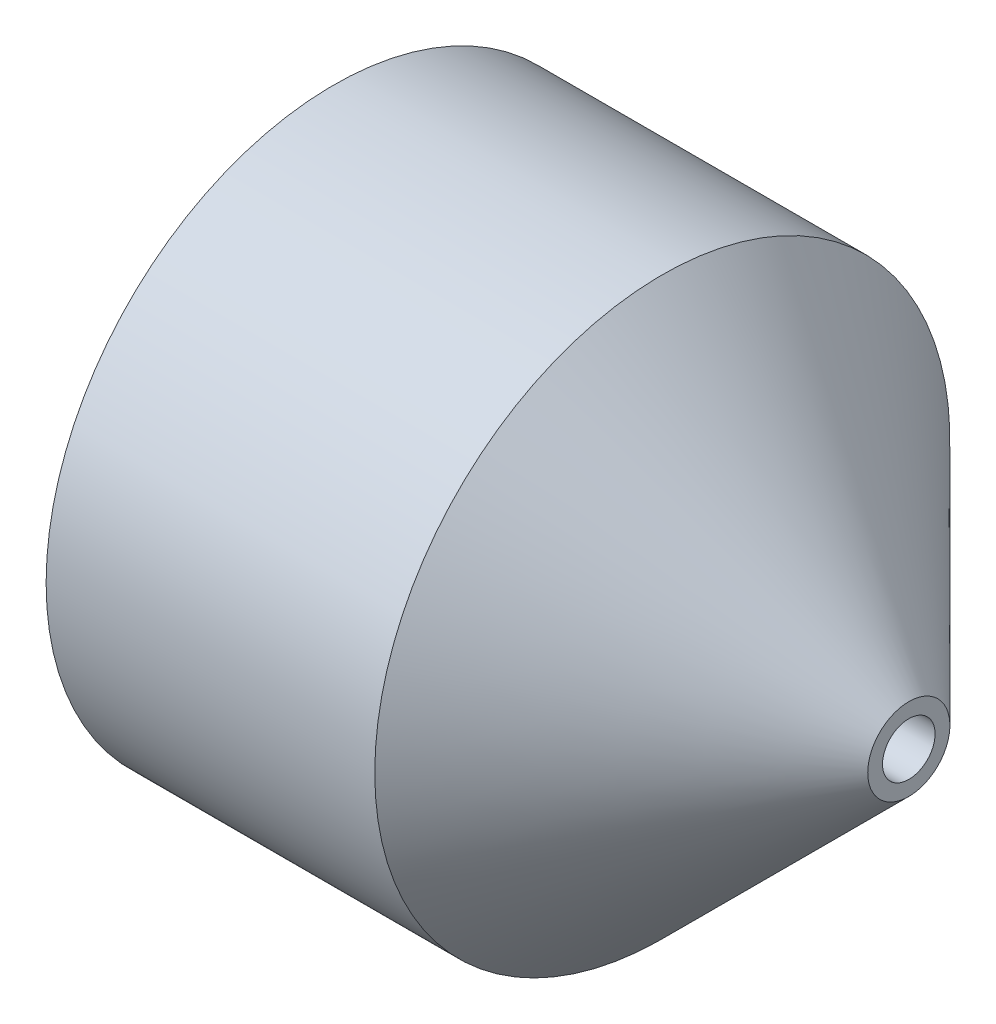
ISO-10303-21;
HEADER;
FILE_DESCRIPTION(('STEP AP214'),'2;1');
FILE_NAME('part.step','',(''),(''),'','','');
FILE_SCHEMA(('AUTOMOTIVE_DESIGN { 1 0 10303 214 1 1 1 1 }'));
ENDSEC;
DATA;
#1=APPLICATION_CONTEXT('core data for automotive mechanical design processes');
#2=APPLICATION_PROTOCOL_DEFINITION('international standard','automotive_design',2000,#1);
#3=PRODUCT_CONTEXT('',#1,'mechanical');
#4=PRODUCT('Part','Part','',(#3));
#5=PRODUCT_RELATED_PRODUCT_CATEGORY('part','',(#4));
#6=PRODUCT_DEFINITION_FORMATION('','',#4);
#7=PRODUCT_DEFINITION_CONTEXT('part definition',#1,'design');
#8=PRODUCT_DEFINITION('design','',#6,#7);
#9=PRODUCT_DEFINITION_SHAPE('','',#8);
#10=(LENGTH_UNIT() NAMED_UNIT(*) SI_UNIT(.MILLI.,.METRE.));
#11=(NAMED_UNIT(*) PLANE_ANGLE_UNIT() SI_UNIT($,.RADIAN.));
#12=(NAMED_UNIT(*) SI_UNIT($,.STERADIAN.) SOLID_ANGLE_UNIT());
#13=UNCERTAINTY_MEASURE_WITH_UNIT(LENGTH_MEASURE(1.E-05),#10,'distance_accuracy_value','');
#14=(GEOMETRIC_REPRESENTATION_CONTEXT(3) GLOBAL_UNCERTAINTY_ASSIGNED_CONTEXT((#13)) GLOBAL_UNIT_ASSIGNED_CONTEXT((#10,
#11,#12)) REPRESENTATION_CONTEXT('',''));
#15=CARTESIAN_POINT('',(0.,0.,0.));
#16=DIRECTION('',(0.,0.,1.));
#17=DIRECTION('',(1.,0.,0.));
#18=AXIS2_PLACEMENT_3D('',#15,#16,#17);
#19=CARTESIAN_POINT('',(12.8499999999999,0.,0.));
#20=DIRECTION('',(-1.,0.,0.));
#21=DIRECTION('',(0.,0.,1.));
#22=AXIS2_PLACEMENT_3D('',#19,#20,#21);
#23=CONICAL_SURFACE('',#22,11.75,0.785398163397443);
#24=CARTESIAN_POINT('',(23.,0.,0.));
#25=DIRECTION('',(-1.,0.,0.));
#26=DIRECTION('',(0.,0.,1.));
#27=AXIS2_PLACEMENT_3D('',#24,#25,#26);
#28=CIRCLE('',#27,1.6);
#29=CARTESIAN_POINT('',(23.,0.,1.6));
#30=VERTEX_POINT('',#29);
#31=EDGE_CURVE('E11',#30,#30,#28,.T.);
#32=ORIENTED_EDGE('',*,*,#31,.F.);
#33=EDGE_LOOP('',(#32));
#34=FACE_BOUND('',#33,.T.);
#35=CARTESIAN_POINT('',(12.8499999999999,0.,0.));
#36=DIRECTION('',(-1.,0.,0.));
#37=DIRECTION('',(0.,0.,1.));
#38=AXIS2_PLACEMENT_3D('',#35,#36,#37);
#39=CIRCLE('',#38,11.75);
#40=CARTESIAN_POINT('',(12.8499999999999,0.,11.75));
#41=VERTEX_POINT('',#40);
#42=EDGE_CURVE('E67',#41,#41,#39,.T.);
#43=ORIENTED_EDGE('',*,*,#42,.T.);
#44=EDGE_LOOP('',(#43));
#45=FACE_BOUND('',#44,.T.);
#46=ADVANCED_FACE('F40',(#34,#45),#23,.F.);
#47=CARTESIAN_POINT('',(-79.4340300993779,0.,0.));
#48=DIRECTION('',(-1.,0.,0.));
#49=DIRECTION('',(0.,0.,1.));
#50=AXIS2_PLACEMENT_3D('',#47,#48,#49);
#51=CYLINDRICAL_SURFACE('',#50,1.6);
#52=CARTESIAN_POINT('',(35.,0.,0.));
#53=DIRECTION('',(-1.,0.,0.));
#54=DIRECTION('',(0.,0.,1.));
#55=AXIS2_PLACEMENT_3D('',#52,#53,#54);
#56=CIRCLE('',#55,1.6);
#57=CARTESIAN_POINT('',(35.,0.,1.6));
#58=VERTEX_POINT('',#57);
#59=EDGE_CURVE('E48',#58,#58,#56,.T.);
#60=ORIENTED_EDGE('',*,*,#59,.F.);
#61=EDGE_LOOP('',(#60));
#62=FACE_BOUND('',#61,.T.);
#63=ORIENTED_EDGE('',*,*,#31,.T.);
#64=EDGE_LOOP('',(#63));
#65=FACE_BOUND('',#64,.T.);
#66=ADVANCED_FACE('F98',(#62,#65),#51,.F.);
#67=CARTESIAN_POINT('',(35.,1.6,0.));
#68=DIRECTION('',(-1.,0.,0.));
#69=DIRECTION('',(0.,0.,1.));
#70=AXIS2_PLACEMENT_3D('',#67,#68,#69);
#71=PLANE('',#70);
#72=CARTESIAN_POINT('',(35.,0.,0.));
#73=DIRECTION('',(-1.,0.,0.));
#74=DIRECTION('',(0.,0.,1.));
#75=AXIS2_PLACEMENT_3D('',#72,#73,#74);
#76=CIRCLE('',#75,2.5);
#77=CARTESIAN_POINT('',(35.,0.,2.5));
#78=VERTEX_POINT('',#77);
#79=EDGE_CURVE('E52',#78,#78,#76,.T.);
#80=ORIENTED_EDGE('',*,*,#79,.F.);
#81=EDGE_LOOP('',(#80));
#82=FACE_BOUND('',#81,.T.);
#83=ORIENTED_EDGE('',*,*,#59,.T.);
#84=EDGE_LOOP('',(#83));
#85=FACE_BOUND('',#84,.T.);
#86=ADVANCED_FACE('F93',(#82,#85),#71,.F.);
#87=CARTESIAN_POINT('',(35.,0.,0.));
#88=DIRECTION('',(-1.,0.,0.));
#89=DIRECTION('',(0.,0.,1.));
#90=AXIS2_PLACEMENT_3D('',#87,#88,#89);
#91=CONICAL_SURFACE('',#90,2.5,0.785398163397449);
#92=CARTESIAN_POINT('',(20.,0.,0.));
#93=DIRECTION('',(-1.,0.,0.));
#94=DIRECTION('',(0.,0.,1.));
#95=AXIS2_PLACEMENT_3D('',#92,#93,#94);
#96=CIRCLE('',#95,17.5);
#97=CARTESIAN_POINT('',(20.,0.,17.5));
#98=VERTEX_POINT('',#97);
#99=EDGE_CURVE('E56',#98,#98,#96,.T.);
#100=ORIENTED_EDGE('',*,*,#99,.F.);
#101=EDGE_LOOP('',(#100));
#102=FACE_BOUND('',#101,.T.);
#103=ORIENTED_EDGE('',*,*,#79,.T.);
#104=EDGE_LOOP('',(#103));
#105=FACE_BOUND('',#104,.T.);
#106=ADVANCED_FACE('F87',(#102,#105),#91,.T.);
#107=CARTESIAN_POINT('',(-79.4340300993779,0.,0.));
#108=DIRECTION('',(-1.,0.,0.));
#109=DIRECTION('',(0.,0.,1.));
#110=AXIS2_PLACEMENT_3D('',#107,#108,#109);
#111=CYLINDRICAL_SURFACE('',#110,17.5);
#112=CARTESIAN_POINT('',(0.,0.,0.));
#113=DIRECTION('',(-1.,0.,0.));
#114=DIRECTION('',(0.,0.,1.));
#115=AXIS2_PLACEMENT_3D('',#112,#113,#114);
#116=CIRCLE('',#115,17.5);
#117=CARTESIAN_POINT('',(0.,0.,17.5));
#118=VERTEX_POINT('',#117);
#119=EDGE_CURVE('E61',#118,#118,#116,.T.);
#120=ORIENTED_EDGE('',*,*,#119,.F.);
#121=EDGE_LOOP('',(#120));
#122=FACE_BOUND('',#121,.T.);
#123=ORIENTED_EDGE('',*,*,#99,.T.);
#124=EDGE_LOOP('',(#123));
#125=FACE_BOUND('',#124,.T.);
#126=ADVANCED_FACE('F81',(#122,#125),#111,.T.);
#127=CARTESIAN_POINT('',(0.,11.75,0.));
#128=DIRECTION('',(1.,0.,0.));
#129=DIRECTION('',(0.,0.,-1.));
#130=AXIS2_PLACEMENT_3D('',#127,#128,#129);
#131=PLANE('',#130);
#132=CARTESIAN_POINT('',(0.,0.,0.));
#133=DIRECTION('',(-1.,0.,0.));
#134=DIRECTION('',(0.,0.,1.));
#135=AXIS2_PLACEMENT_3D('',#132,#133,#134);
#136=CIRCLE('',#135,11.75);
#137=CARTESIAN_POINT('',(0.,0.,11.75));
#138=VERTEX_POINT('',#137);
#139=EDGE_CURVE('E64',#138,#138,#136,.T.);
#140=ORIENTED_EDGE('',*,*,#139,.F.);
#141=EDGE_LOOP('',(#140));
#142=FACE_BOUND('',#141,.T.);
#143=ORIENTED_EDGE('',*,*,#119,.T.);
#144=EDGE_LOOP('',(#143));
#145=FACE_BOUND('',#144,.T.);
#146=ADVANCED_FACE('F75',(#142,#145),#131,.F.);
#147=CARTESIAN_POINT('',(-79.4340300993779,0.,0.));
#148=DIRECTION('',(-1.,0.,0.));
#149=DIRECTION('',(0.,0.,1.));
#150=AXIS2_PLACEMENT_3D('',#147,#148,#149);
#151=CYLINDRICAL_SURFACE('',#150,11.75);
#152=ORIENTED_EDGE('',*,*,#42,.F.);
#153=EDGE_LOOP('',(#152));
#154=FACE_BOUND('',#153,.T.);
#155=ORIENTED_EDGE('',*,*,#139,.T.);
#156=EDGE_LOOP('',(#155));
#157=FACE_BOUND('',#156,.T.);
#158=ADVANCED_FACE('F72',(#154,#157),#151,.F.);
#159=CLOSED_SHELL('',(#46,#66,#86,#106,#126,#146,#158));
#160=MANIFOLD_SOLID_BREP('B2',#159);
#161=ADVANCED_BREP_SHAPE_REPRESENTATION('',(#18,#160),#14);
#162=SHAPE_DEFINITION_REPRESENTATION(#9,#161);
ENDSEC;
END-ISO-10303-21;
